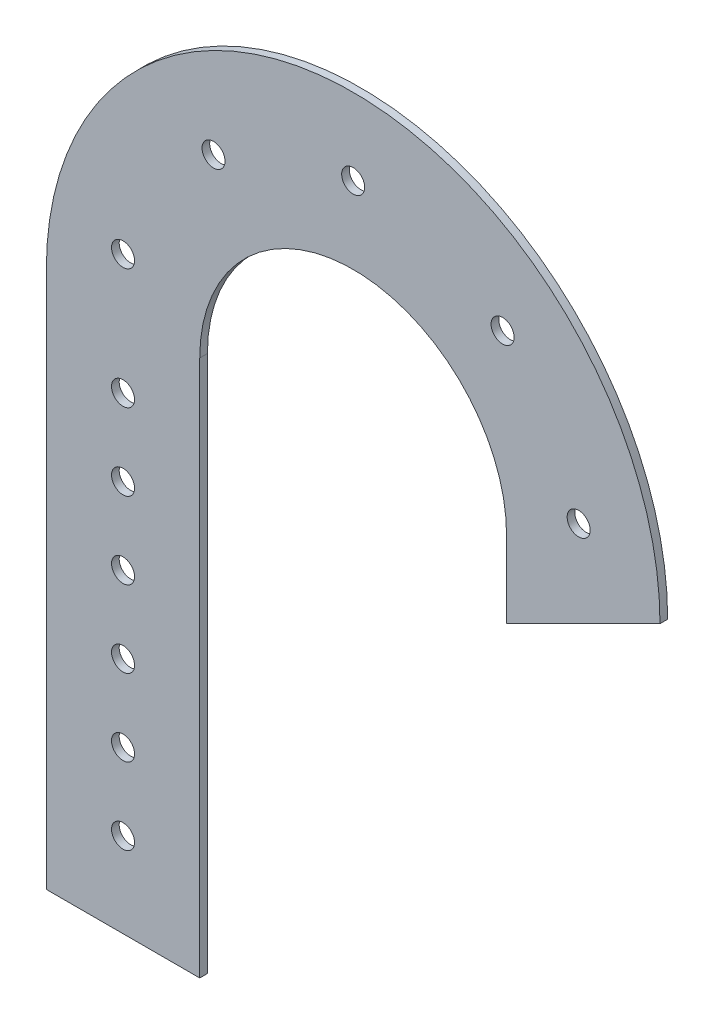
ISO-10303-21;
HEADER;
FILE_DESCRIPTION(('STEP AP214'),'2;1');
FILE_NAME('part.step','',(''),(''),'','','');
FILE_SCHEMA(('AUTOMOTIVE_DESIGN { 1 0 10303 214 1 1 1 1 }'));
ENDSEC;
DATA;
#1=APPLICATION_CONTEXT('core data for automotive mechanical design processes');
#2=APPLICATION_PROTOCOL_DEFINITION('international standard','automotive_design',2000,#1);
#3=PRODUCT_CONTEXT('',#1,'mechanical');
#4=PRODUCT('Part','Part','',(#3));
#5=PRODUCT_RELATED_PRODUCT_CATEGORY('part','',(#4));
#6=PRODUCT_DEFINITION_FORMATION('','',#4);
#7=PRODUCT_DEFINITION_CONTEXT('part definition',#1,'design');
#8=PRODUCT_DEFINITION('design','',#6,#7);
#9=PRODUCT_DEFINITION_SHAPE('','',#8);
#10=(LENGTH_UNIT() NAMED_UNIT(*) SI_UNIT(.MILLI.,.METRE.));
#11=(NAMED_UNIT(*) PLANE_ANGLE_UNIT() SI_UNIT($,.RADIAN.));
#12=(NAMED_UNIT(*) SI_UNIT($,.STERADIAN.) SOLID_ANGLE_UNIT());
#13=UNCERTAINTY_MEASURE_WITH_UNIT(LENGTH_MEASURE(1.E-05),#10,'distance_accuracy_value','');
#14=(GEOMETRIC_REPRESENTATION_CONTEXT(3) GLOBAL_UNCERTAINTY_ASSIGNED_CONTEXT((#13)) GLOBAL_UNIT_ASSIGNED_CONTEXT((#10,
#11,#12)) REPRESENTATION_CONTEXT('',''));
#15=CARTESIAN_POINT('',(0.,0.,0.));
#16=DIRECTION('',(0.,0.,1.));
#17=DIRECTION('',(1.,0.,0.));
#18=AXIS2_PLACEMENT_3D('',#15,#16,#17);
#19=CARTESIAN_POINT('',(0.,0.,2.54));
#20=DIRECTION('',(0.,0.,1.));
#21=DIRECTION('',(1.,0.,0.));
#22=AXIS2_PLACEMENT_3D('',#19,#20,#21);
#23=PLANE('',#22);
#24=CARTESIAN_POINT('',(-76.2,-124.348228379856,2.54));
#25=DIRECTION('',(0.,0.,1.));
#26=DIRECTION('',(1.,0.,0.));
#27=AXIS2_PLACEMENT_3D('',#24,#25,#26);
#28=CIRCLE('',#27,3.81);
#29=CARTESIAN_POINT('',(-72.39,-124.348228379856,2.54));
#30=VERTEX_POINT('',#29);
#31=EDGE_CURVE('E214',#30,#30,#28,.T.);
#32=ORIENTED_EDGE('',*,*,#31,.F.);
#33=EDGE_LOOP('',(#32));
#34=FACE_BOUND('',#33,.T.);
#35=CARTESIAN_POINT('',(-76.2,-73.548228379856,2.54));
#36=DIRECTION('',(0.,0.,1.));
#37=DIRECTION('',(1.,0.,0.));
#38=AXIS2_PLACEMENT_3D('',#35,#36,#37);
#39=CIRCLE('',#38,3.81);
#40=CARTESIAN_POINT('',(-72.39,-73.548228379856,2.54));
#41=VERTEX_POINT('',#40);
#42=EDGE_CURVE('E202',#41,#41,#39,.T.);
#43=ORIENTED_EDGE('',*,*,#42,.F.);
#44=EDGE_LOOP('',(#43));
#45=FACE_BOUND('',#44,.T.);
#46=CARTESIAN_POINT('',(-76.2,-22.748228379856,2.54));
#47=DIRECTION('',(0.,0.,1.));
#48=DIRECTION('',(1.,0.,0.));
#49=AXIS2_PLACEMENT_3D('',#46,#47,#48);
#50=CIRCLE('',#49,3.81);
#51=CARTESIAN_POINT('',(-72.39,-22.748228379856,2.54));
#52=VERTEX_POINT('',#51);
#53=EDGE_CURVE('E190',#52,#52,#50,.T.);
#54=ORIENTED_EDGE('',*,*,#53,.F.);
#55=EDGE_LOOP('',(#54));
#56=FACE_BOUND('',#55,.T.);
#57=CARTESIAN_POINT('',(74.6636960903211,15.2240758712036,2.54));
#58=DIRECTION('',(0.,0.,1.));
#59=DIRECTION('',(1.,0.,0.));
#60=AXIS2_PLACEMENT_3D('',#57,#58,#59);
#61=CIRCLE('',#60,3.81);
#62=CARTESIAN_POINT('',(78.4736960903211,15.2240758712036,2.54));
#63=VERTEX_POINT('',#62);
#64=EDGE_CURVE('E178',#63,#63,#61,.T.);
#65=ORIENTED_EDGE('',*,*,#64,.F.);
#66=EDGE_LOOP('',(#65));
#67=FACE_BOUND('',#66,.T.);
#68=CARTESIAN_POINT('',(-76.2,17.081132640774,2.54));
#69=DIRECTION('',(0.,0.,1.));
#70=DIRECTION('',(1.,0.,0.));
#71=AXIS2_PLACEMENT_3D('',#68,#69,#70);
#72=CIRCLE('',#71,3.81);
#73=CARTESIAN_POINT('',(-72.39,17.081132640774,2.54));
#74=VERTEX_POINT('',#73);
#75=EDGE_CURVE('E166',#74,#74,#72,.T.);
#76=ORIENTED_EDGE('',*,*,#75,.F.);
#77=EDGE_LOOP('',(#76));
#78=FACE_BOUND('',#77,.T.);
#79=DIRECTION('',(1.,0.,0.));
#80=VECTOR('',#79,1.);
#81=CARTESIAN_POINT('',(-101.6,-177.8,2.54));
#82=LINE('',#81,#80);
#83=CARTESIAN_POINT('',(-101.6,-177.8,2.54));
#84=VERTEX_POINT('',#83);
#85=CARTESIAN_POINT('',(-50.8,-177.8,2.54));
#86=VERTEX_POINT('',#85);
#87=EDGE_CURVE('E139',#84,#86,#82,.T.);
#88=ORIENTED_EDGE('',*,*,#87,.T.);
#89=DIRECTION('',(0.,1.,0.));
#90=VECTOR('',#89,1.);
#91=CARTESIAN_POINT('',(-50.8,0.,2.54));
#92=LINE('',#91,#90);
#93=CARTESIAN_POINT('',(-50.8,0.,2.54));
#94=VERTEX_POINT('',#93);
#95=EDGE_CURVE('E92',#86,#94,#92,.T.);
#96=ORIENTED_EDGE('',*,*,#95,.T.);
#97=CARTESIAN_POINT('',(0.,0.,2.54));
#98=DIRECTION('',(0.,0.,-1.));
#99=DIRECTION('',(1.,0.,0.));
#100=AXIS2_PLACEMENT_3D('',#97,#98,#99);
#101=CIRCLE('',#100,50.8);
#102=CARTESIAN_POINT('',(50.8,0.,2.54));
#103=VERTEX_POINT('',#102);
#104=EDGE_CURVE('E151',#94,#103,#101,.T.);
#105=ORIENTED_EDGE('',*,*,#104,.T.);
#106=DIRECTION('',(0.,-1.,0.));
#107=VECTOR('',#106,1.);
#108=CARTESIAN_POINT('',(50.8,0.,2.54));
#109=LINE('',#108,#107);
#110=CARTESIAN_POINT('',(50.8,-25.4,2.54));
#111=VERTEX_POINT('',#110);
#112=EDGE_CURVE('E108',#103,#111,#109,.T.);
#113=ORIENTED_EDGE('',*,*,#112,.T.);
#114=DIRECTION('',(0.894427190999916,0.447213595499957,0.));
#115=VECTOR('',#114,1.);
#116=CARTESIAN_POINT('',(101.6,0.,2.54));
#117=LINE('',#116,#115);
#118=CARTESIAN_POINT('',(101.6,0.,2.54));
#119=VERTEX_POINT('',#118);
#120=EDGE_CURVE('E102',#111,#119,#117,.T.);
#121=ORIENTED_EDGE('',*,*,#120,.T.);
#122=CARTESIAN_POINT('',(0.,0.,2.54));
#123=DIRECTION('',(0.,0.,1.));
#124=DIRECTION('',(1.,0.,0.));
#125=AXIS2_PLACEMENT_3D('',#122,#123,#124);
#126=CIRCLE('',#125,101.6);
#127=CARTESIAN_POINT('',(-101.6,0.,2.54));
#128=VERTEX_POINT('',#127);
#129=EDGE_CURVE('E106',#119,#128,#126,.T.);
#130=ORIENTED_EDGE('',*,*,#129,.T.);
#131=DIRECTION('',(0.,-1.,0.));
#132=VECTOR('',#131,1.);
#133=CARTESIAN_POINT('',(-101.6,0.,2.54));
#134=LINE('',#133,#132);
#135=EDGE_CURVE('E52',#128,#84,#134,.T.);
#136=ORIENTED_EDGE('',*,*,#135,.T.);
#137=EDGE_LOOP('',(#88,#96,#105,#113,#121,#130,#136));
#138=FACE_BOUND('',#137,.T.);
#139=CARTESIAN_POINT('',(-46.2343927009083,60.5707927270083,2.54));
#140=DIRECTION('',(0.,0.,1.));
#141=DIRECTION('',(1.,0.,0.));
#142=AXIS2_PLACEMENT_3D('',#139,#140,#141);
#143=CIRCLE('',#142,3.81);
#144=CARTESIAN_POINT('',(-42.4243927009083,60.5707927270083,2.54));
#145=VERTEX_POINT('',#144);
#146=EDGE_CURVE('E130',#145,#145,#143,.T.);
#147=ORIENTED_EDGE('',*,*,#146,.F.);
#148=EDGE_LOOP('',(#147));
#149=FACE_BOUND('',#148,.T.);
#150=CARTESIAN_POINT('',(0.,76.2,2.54));
#151=DIRECTION('',(0.,0.,1.));
#152=DIRECTION('',(1.,0.,0.));
#153=AXIS2_PLACEMENT_3D('',#150,#151,#152);
#154=CIRCLE('',#153,3.81);
#155=CARTESIAN_POINT('',(3.81,76.2,2.54));
#156=VERTEX_POINT('',#155);
#157=EDGE_CURVE('E172',#156,#156,#154,.T.);
#158=ORIENTED_EDGE('',*,*,#157,.F.);
#159=EDGE_LOOP('',(#158));
#160=FACE_BOUND('',#159,.T.);
#161=CARTESIAN_POINT('',(49.4781723324039,57.951276626533,2.54));
#162=DIRECTION('',(0.,0.,1.));
#163=DIRECTION('',(1.,0.,0.));
#164=AXIS2_PLACEMENT_3D('',#161,#162,#163);
#165=CIRCLE('',#164,3.81);
#166=CARTESIAN_POINT('',(53.2881723324038,57.951276626533,2.54));
#167=VERTEX_POINT('',#166);
#168=EDGE_CURVE('E184',#167,#167,#165,.T.);
#169=ORIENTED_EDGE('',*,*,#168,.F.);
#170=EDGE_LOOP('',(#169));
#171=FACE_BOUND('',#170,.T.);
#172=CARTESIAN_POINT('',(-76.2,-48.148228379856,2.54));
#173=DIRECTION('',(0.,0.,1.));
#174=DIRECTION('',(1.,0.,0.));
#175=AXIS2_PLACEMENT_3D('',#172,#173,#174);
#176=CIRCLE('',#175,3.81);
#177=CARTESIAN_POINT('',(-72.39,-48.148228379856,2.54));
#178=VERTEX_POINT('',#177);
#179=EDGE_CURVE('E196',#178,#178,#176,.T.);
#180=ORIENTED_EDGE('',*,*,#179,.F.);
#181=EDGE_LOOP('',(#180));
#182=FACE_BOUND('',#181,.T.);
#183=CARTESIAN_POINT('',(-76.2,-98.948228379856,2.54));
#184=DIRECTION('',(0.,0.,1.));
#185=DIRECTION('',(1.,0.,0.));
#186=AXIS2_PLACEMENT_3D('',#183,#184,#185);
#187=CIRCLE('',#186,3.81);
#188=CARTESIAN_POINT('',(-72.39,-98.948228379856,2.54));
#189=VERTEX_POINT('',#188);
#190=EDGE_CURVE('E208',#189,#189,#187,.T.);
#191=ORIENTED_EDGE('',*,*,#190,.F.);
#192=EDGE_LOOP('',(#191));
#193=FACE_BOUND('',#192,.T.);
#194=CARTESIAN_POINT('',(-76.2,-149.748228379856,2.54));
#195=DIRECTION('',(0.,0.,1.));
#196=DIRECTION('',(1.,0.,0.));
#197=AXIS2_PLACEMENT_3D('',#194,#195,#196);
#198=CIRCLE('',#197,3.81000000000002);
#199=CARTESIAN_POINT('',(-72.39,-149.748228379856,2.54));
#200=VERTEX_POINT('',#199);
#201=EDGE_CURVE('E220',#200,#200,#198,.T.);
#202=ORIENTED_EDGE('',*,*,#201,.F.);
#203=EDGE_LOOP('',(#202));
#204=FACE_BOUND('',#203,.T.);
#205=ADVANCED_FACE('F35',(#34,#45,#56,#67,#78,#138,#149,#160,#171,#182,#193,#204),#23,.T.);
#206=CARTESIAN_POINT('',(0.,0.,0.));
#207=DIRECTION('',(0.,0.,1.));
#208=DIRECTION('',(1.,0.,0.));
#209=AXIS2_PLACEMENT_3D('',#206,#207,#208);
#210=PLANE('',#209);
#211=DIRECTION('',(1.,0.,0.));
#212=VECTOR('',#211,1.);
#213=CARTESIAN_POINT('',(-101.6,-177.8,0.));
#214=LINE('',#213,#212);
#215=CARTESIAN_POINT('',(-101.6,-177.8,0.));
#216=VERTEX_POINT('',#215);
#217=CARTESIAN_POINT('',(-50.8,-177.8,0.));
#218=VERTEX_POINT('',#217);
#219=EDGE_CURVE('E126',#216,#218,#214,.T.);
#220=ORIENTED_EDGE('',*,*,#219,.F.);
#221=DIRECTION('',(0.,-1.,0.));
#222=VECTOR('',#221,1.);
#223=CARTESIAN_POINT('',(-101.6,0.,0.));
#224=LINE('',#223,#222);
#225=CARTESIAN_POINT('',(-101.6,0.,0.));
#226=VERTEX_POINT('',#225);
#227=EDGE_CURVE('E84',#226,#216,#224,.T.);
#228=ORIENTED_EDGE('',*,*,#227,.F.);
#229=CARTESIAN_POINT('',(0.,0.,0.));
#230=DIRECTION('',(0.,0.,1.));
#231=DIRECTION('',(1.,0.,0.));
#232=AXIS2_PLACEMENT_3D('',#229,#230,#231);
#233=CIRCLE('',#232,101.6);
#234=CARTESIAN_POINT('',(101.6,0.,0.));
#235=VERTEX_POINT('',#234);
#236=EDGE_CURVE('E78',#235,#226,#233,.T.);
#237=ORIENTED_EDGE('',*,*,#236,.F.);
#238=DIRECTION('',(0.894427190999916,0.447213595499957,0.));
#239=VECTOR('',#238,1.);
#240=CARTESIAN_POINT('',(101.6,0.,0.));
#241=LINE('',#240,#239);
#242=CARTESIAN_POINT('',(50.8,-25.4,0.));
#243=VERTEX_POINT('',#242);
#244=EDGE_CURVE('E116',#243,#235,#241,.T.);
#245=ORIENTED_EDGE('',*,*,#244,.F.);
#246=DIRECTION('',(0.,-1.,0.));
#247=VECTOR('',#246,1.);
#248=CARTESIAN_POINT('',(50.8,0.,0.));
#249=LINE('',#248,#247);
#250=CARTESIAN_POINT('',(50.8,0.,0.));
#251=VERTEX_POINT('',#250);
#252=EDGE_CURVE('E134',#251,#243,#249,.T.);
#253=ORIENTED_EDGE('',*,*,#252,.F.);
#254=CARTESIAN_POINT('',(0.,0.,0.));
#255=DIRECTION('',(0.,0.,-1.));
#256=DIRECTION('',(1.,0.,0.));
#257=AXIS2_PLACEMENT_3D('',#254,#255,#256);
#258=CIRCLE('',#257,50.8);
#259=CARTESIAN_POINT('',(-50.8,0.,0.));
#260=VERTEX_POINT('',#259);
#261=EDGE_CURVE('E132',#260,#251,#258,.T.);
#262=ORIENTED_EDGE('',*,*,#261,.F.);
#263=DIRECTION('',(0.,1.,0.));
#264=VECTOR('',#263,1.);
#265=CARTESIAN_POINT('',(-50.8,0.,0.));
#266=LINE('',#265,#264);
#267=EDGE_CURVE('E129',#218,#260,#266,.T.);
#268=ORIENTED_EDGE('',*,*,#267,.F.);
#269=EDGE_LOOP('',(#220,#228,#237,#245,#253,#262,#268));
#270=FACE_BOUND('',#269,.T.);
#271=CARTESIAN_POINT('',(-46.2343927009083,60.5707927270083,0.));
#272=DIRECTION('',(0.,0.,1.));
#273=DIRECTION('',(1.,0.,0.));
#274=AXIS2_PLACEMENT_3D('',#271,#272,#273);
#275=CIRCLE('',#274,3.81);
#276=CARTESIAN_POINT('',(-42.4243927009083,60.5707927270083,0.));
#277=VERTEX_POINT('',#276);
#278=EDGE_CURVE('E163',#277,#277,#275,.T.);
#279=ORIENTED_EDGE('',*,*,#278,.T.);
#280=EDGE_LOOP('',(#279));
#281=FACE_BOUND('',#280,.T.);
#282=CARTESIAN_POINT('',(-76.2,17.081132640774,0.));
#283=DIRECTION('',(0.,0.,1.));
#284=DIRECTION('',(1.,0.,0.));
#285=AXIS2_PLACEMENT_3D('',#282,#283,#284);
#286=CIRCLE('',#285,3.81);
#287=CARTESIAN_POINT('',(-72.39,17.081132640774,0.));
#288=VERTEX_POINT('',#287);
#289=EDGE_CURVE('E169',#288,#288,#286,.T.);
#290=ORIENTED_EDGE('',*,*,#289,.T.);
#291=EDGE_LOOP('',(#290));
#292=FACE_BOUND('',#291,.T.);
#293=CARTESIAN_POINT('',(0.,76.2,0.));
#294=DIRECTION('',(0.,0.,1.));
#295=DIRECTION('',(1.,0.,0.));
#296=AXIS2_PLACEMENT_3D('',#293,#294,#295);
#297=CIRCLE('',#296,3.81);
#298=CARTESIAN_POINT('',(3.81,76.2,0.));
#299=VERTEX_POINT('',#298);
#300=EDGE_CURVE('E175',#299,#299,#297,.T.);
#301=ORIENTED_EDGE('',*,*,#300,.T.);
#302=EDGE_LOOP('',(#301));
#303=FACE_BOUND('',#302,.T.);
#304=CARTESIAN_POINT('',(74.6636960903211,15.2240758712036,0.));
#305=DIRECTION('',(0.,0.,1.));
#306=DIRECTION('',(1.,0.,0.));
#307=AXIS2_PLACEMENT_3D('',#304,#305,#306);
#308=CIRCLE('',#307,3.81);
#309=CARTESIAN_POINT('',(78.4736960903211,15.2240758712036,0.));
#310=VERTEX_POINT('',#309);
#311=EDGE_CURVE('E181',#310,#310,#308,.T.);
#312=ORIENTED_EDGE('',*,*,#311,.T.);
#313=EDGE_LOOP('',(#312));
#314=FACE_BOUND('',#313,.T.);
#315=CARTESIAN_POINT('',(49.4781723324039,57.951276626533,0.));
#316=DIRECTION('',(0.,0.,1.));
#317=DIRECTION('',(1.,0.,0.));
#318=AXIS2_PLACEMENT_3D('',#315,#316,#317);
#319=CIRCLE('',#318,3.81);
#320=CARTESIAN_POINT('',(53.2881723324038,57.951276626533,0.));
#321=VERTEX_POINT('',#320);
#322=EDGE_CURVE('E187',#321,#321,#319,.T.);
#323=ORIENTED_EDGE('',*,*,#322,.T.);
#324=EDGE_LOOP('',(#323));
#325=FACE_BOUND('',#324,.T.);
#326=CARTESIAN_POINT('',(-76.2,-22.748228379856,0.));
#327=DIRECTION('',(0.,0.,1.));
#328=DIRECTION('',(1.,0.,0.));
#329=AXIS2_PLACEMENT_3D('',#326,#327,#328);
#330=CIRCLE('',#329,3.81);
#331=CARTESIAN_POINT('',(-72.39,-22.748228379856,0.));
#332=VERTEX_POINT('',#331);
#333=EDGE_CURVE('E193',#332,#332,#330,.T.);
#334=ORIENTED_EDGE('',*,*,#333,.T.);
#335=EDGE_LOOP('',(#334));
#336=FACE_BOUND('',#335,.T.);
#337=CARTESIAN_POINT('',(-76.2,-48.148228379856,0.));
#338=DIRECTION('',(0.,0.,1.));
#339=DIRECTION('',(1.,0.,0.));
#340=AXIS2_PLACEMENT_3D('',#337,#338,#339);
#341=CIRCLE('',#340,3.81);
#342=CARTESIAN_POINT('',(-72.39,-48.148228379856,0.));
#343=VERTEX_POINT('',#342);
#344=EDGE_CURVE('E199',#343,#343,#341,.T.);
#345=ORIENTED_EDGE('',*,*,#344,.T.);
#346=EDGE_LOOP('',(#345));
#347=FACE_BOUND('',#346,.T.);
#348=CARTESIAN_POINT('',(-76.2,-73.548228379856,0.));
#349=DIRECTION('',(0.,0.,1.));
#350=DIRECTION('',(1.,0.,0.));
#351=AXIS2_PLACEMENT_3D('',#348,#349,#350);
#352=CIRCLE('',#351,3.81);
#353=CARTESIAN_POINT('',(-72.39,-73.548228379856,0.));
#354=VERTEX_POINT('',#353);
#355=EDGE_CURVE('E205',#354,#354,#352,.T.);
#356=ORIENTED_EDGE('',*,*,#355,.T.);
#357=EDGE_LOOP('',(#356));
#358=FACE_BOUND('',#357,.T.);
#359=CARTESIAN_POINT('',(-76.2,-98.948228379856,0.));
#360=DIRECTION('',(0.,0.,1.));
#361=DIRECTION('',(1.,0.,0.));
#362=AXIS2_PLACEMENT_3D('',#359,#360,#361);
#363=CIRCLE('',#362,3.81);
#364=CARTESIAN_POINT('',(-72.39,-98.948228379856,0.));
#365=VERTEX_POINT('',#364);
#366=EDGE_CURVE('E211',#365,#365,#363,.T.);
#367=ORIENTED_EDGE('',*,*,#366,.T.);
#368=EDGE_LOOP('',(#367));
#369=FACE_BOUND('',#368,.T.);
#370=CARTESIAN_POINT('',(-76.2,-124.348228379856,0.));
#371=DIRECTION('',(0.,0.,1.));
#372=DIRECTION('',(1.,0.,0.));
#373=AXIS2_PLACEMENT_3D('',#370,#371,#372);
#374=CIRCLE('',#373,3.81);
#375=CARTESIAN_POINT('',(-72.39,-124.348228379856,0.));
#376=VERTEX_POINT('',#375);
#377=EDGE_CURVE('E217',#376,#376,#374,.T.);
#378=ORIENTED_EDGE('',*,*,#377,.T.);
#379=EDGE_LOOP('',(#378));
#380=FACE_BOUND('',#379,.T.);
#381=CARTESIAN_POINT('',(-76.2,-149.748228379856,0.));
#382=DIRECTION('',(0.,0.,1.));
#383=DIRECTION('',(1.,0.,0.));
#384=AXIS2_PLACEMENT_3D('',#381,#382,#383);
#385=CIRCLE('',#384,3.81000000000002);
#386=CARTESIAN_POINT('',(-72.39,-149.748228379856,0.));
#387=VERTEX_POINT('',#386);
#388=EDGE_CURVE('E223',#387,#387,#385,.T.);
#389=ORIENTED_EDGE('',*,*,#388,.T.);
#390=EDGE_LOOP('',(#389));
#391=FACE_BOUND('',#390,.T.);
#392=ADVANCED_FACE('F155',(#270,#281,#292,#303,#314,#325,#336,#347,#358,#369,#380,#391),#210,.F.);
#393=CARTESIAN_POINT('',(-101.6,-177.8,2.54));
#394=DIRECTION('',(0.,1.,0.));
#395=DIRECTION('',(0.,0.,1.));
#396=AXIS2_PLACEMENT_3D('',#393,#394,#395);
#397=PLANE('',#396);
#398=ORIENTED_EDGE('',*,*,#219,.T.);
#399=DIRECTION('',(0.,0.,-1.));
#400=VECTOR('',#399,1.);
#401=CARTESIAN_POINT('',(-50.8,-177.8,2.54));
#402=LINE('',#401,#400);
#403=EDGE_CURVE('E11',#86,#218,#402,.T.);
#404=ORIENTED_EDGE('',*,*,#403,.F.);
#405=ORIENTED_EDGE('',*,*,#87,.F.);
#406=DIRECTION('',(0.,0.,-1.));
#407=VECTOR('',#406,1.);
#408=CARTESIAN_POINT('',(-101.6,-177.8,2.54));
#409=LINE('',#408,#407);
#410=EDGE_CURVE('E122',#84,#216,#409,.T.);
#411=ORIENTED_EDGE('',*,*,#410,.T.);
#412=EDGE_LOOP('',(#398,#404,#405,#411));
#413=FACE_BOUND('',#412,.T.);
#414=ADVANCED_FACE('F37',(#413),#397,.F.);
#415=CARTESIAN_POINT('',(-50.8,0.,2.54));
#416=DIRECTION('',(-1.,0.,0.));
#417=DIRECTION('',(0.,0.,1.));
#418=AXIS2_PLACEMENT_3D('',#415,#416,#417);
#419=PLANE('',#418);
#420=ORIENTED_EDGE('',*,*,#267,.T.);
#421=DIRECTION('',(0.,0.,-1.));
#422=VECTOR('',#421,1.);
#423=CARTESIAN_POINT('',(-50.8,0.,2.54));
#424=LINE('',#423,#422);
#425=EDGE_CURVE('E44',#94,#260,#424,.T.);
#426=ORIENTED_EDGE('',*,*,#425,.F.);
#427=ORIENTED_EDGE('',*,*,#95,.F.);
#428=ORIENTED_EDGE('',*,*,#403,.T.);
#429=EDGE_LOOP('',(#420,#426,#427,#428));
#430=FACE_BOUND('',#429,.T.);
#431=ADVANCED_FACE('F255',(#430),#419,.F.);
#432=CARTESIAN_POINT('',(0.,0.,2.54));
#433=DIRECTION('',(0.,0.,-1.));
#434=DIRECTION('',(-1.,0.,0.));
#435=AXIS2_PLACEMENT_3D('',#432,#433,#434);
#436=CYLINDRICAL_SURFACE('',#435,50.8);
#437=ORIENTED_EDGE('',*,*,#261,.T.);
#438=DIRECTION('',(0.,0.,-1.));
#439=VECTOR('',#438,1.);
#440=CARTESIAN_POINT('',(50.8,0.,2.54));
#441=LINE('',#440,#439);
#442=EDGE_CURVE('E143',#103,#251,#441,.T.);
#443=ORIENTED_EDGE('',*,*,#442,.F.);
#444=ORIENTED_EDGE('',*,*,#104,.F.);
#445=ORIENTED_EDGE('',*,*,#425,.T.);
#446=EDGE_LOOP('',(#437,#443,#444,#445));
#447=FACE_BOUND('',#446,.T.);
#448=ADVANCED_FACE('F149',(#447),#436,.F.);
#449=CARTESIAN_POINT('',(50.8,0.,2.54));
#450=DIRECTION('',(1.,0.,0.));
#451=DIRECTION('',(0.,0.,-1.));
#452=AXIS2_PLACEMENT_3D('',#449,#450,#451);
#453=PLANE('',#452);
#454=ORIENTED_EDGE('',*,*,#252,.T.);
#455=DIRECTION('',(0.,0.,-1.));
#456=VECTOR('',#455,1.);
#457=CARTESIAN_POINT('',(50.8,-25.4,2.54));
#458=LINE('',#457,#456);
#459=EDGE_CURVE('E117',#111,#243,#458,.T.);
#460=ORIENTED_EDGE('',*,*,#459,.F.);
#461=ORIENTED_EDGE('',*,*,#112,.F.);
#462=ORIENTED_EDGE('',*,*,#442,.T.);
#463=EDGE_LOOP('',(#454,#460,#461,#462));
#464=FACE_BOUND('',#463,.T.);
#465=ADVANCED_FACE('F158',(#464),#453,.F.);
#466=CARTESIAN_POINT('',(101.6,0.,2.54));
#467=DIRECTION('',(-0.447213595499957,0.894427190999916,0.));
#468=DIRECTION('',(-0.894427190999916,-0.447213595499957,0.));
#469=AXIS2_PLACEMENT_3D('',#466,#467,#468);
#470=PLANE('',#469);
#471=ORIENTED_EDGE('',*,*,#244,.T.);
#472=DIRECTION('',(0.,0.,-1.));
#473=VECTOR('',#472,1.);
#474=CARTESIAN_POINT('',(101.6,0.,2.54));
#475=LINE('',#474,#473);
#476=EDGE_CURVE('E113',#119,#235,#475,.T.);
#477=ORIENTED_EDGE('',*,*,#476,.F.);
#478=ORIENTED_EDGE('',*,*,#120,.F.);
#479=ORIENTED_EDGE('',*,*,#459,.T.);
#480=EDGE_LOOP('',(#471,#477,#478,#479));
#481=FACE_BOUND('',#480,.T.);
#482=ADVANCED_FACE('F114',(#481),#470,.F.);
#483=CARTESIAN_POINT('',(0.,0.,2.54));
#484=DIRECTION('',(0.,0.,-1.));
#485=DIRECTION('',(-1.,0.,0.));
#486=AXIS2_PLACEMENT_3D('',#483,#484,#485);
#487=CYLINDRICAL_SURFACE('',#486,101.6);
#488=ORIENTED_EDGE('',*,*,#236,.T.);
#489=DIRECTION('',(0.,0.,-1.));
#490=VECTOR('',#489,1.);
#491=CARTESIAN_POINT('',(-101.6,0.,2.54));
#492=LINE('',#491,#490);
#493=EDGE_CURVE('E118',#128,#226,#492,.T.);
#494=ORIENTED_EDGE('',*,*,#493,.F.);
#495=ORIENTED_EDGE('',*,*,#129,.F.);
#496=ORIENTED_EDGE('',*,*,#476,.T.);
#497=EDGE_LOOP('',(#488,#494,#495,#496));
#498=FACE_BOUND('',#497,.T.);
#499=ADVANCED_FACE('F120',(#498),#487,.T.);
#500=CARTESIAN_POINT('',(-101.6,0.,2.54));
#501=DIRECTION('',(1.,0.,0.));
#502=DIRECTION('',(0.,1.,0.));
#503=AXIS2_PLACEMENT_3D('',#500,#501,#502);
#504=PLANE('',#503);
#505=ORIENTED_EDGE('',*,*,#227,.T.);
#506=ORIENTED_EDGE('',*,*,#410,.F.);
#507=ORIENTED_EDGE('',*,*,#135,.F.);
#508=ORIENTED_EDGE('',*,*,#493,.T.);
#509=EDGE_LOOP('',(#505,#506,#507,#508));
#510=FACE_BOUND('',#509,.T.);
#511=ADVANCED_FACE('F245',(#510),#504,.F.);
#512=CARTESIAN_POINT('',(-46.2343927009083,60.5707927270083,2.54));
#513=DIRECTION('',(0.,0.,-1.));
#514=DIRECTION('',(-1.,0.,0.));
#515=AXIS2_PLACEMENT_3D('',#512,#513,#514);
#516=CYLINDRICAL_SURFACE('',#515,3.81);
#517=ORIENTED_EDGE('',*,*,#146,.T.);
#518=EDGE_LOOP('',(#517));
#519=FACE_BOUND('',#518,.T.);
#520=ORIENTED_EDGE('',*,*,#278,.F.);
#521=EDGE_LOOP('',(#520));
#522=FACE_BOUND('',#521,.T.);
#523=ADVANCED_FACE('F242',(#519,#522),#516,.F.);
#524=CARTESIAN_POINT('',(-76.2,17.081132640774,2.54));
#525=DIRECTION('',(0.,0.,-1.));
#526=DIRECTION('',(-1.,0.,0.));
#527=AXIS2_PLACEMENT_3D('',#524,#525,#526);
#528=CYLINDRICAL_SURFACE('',#527,3.81);
#529=ORIENTED_EDGE('',*,*,#75,.T.);
#530=EDGE_LOOP('',(#529));
#531=FACE_BOUND('',#530,.T.);
#532=ORIENTED_EDGE('',*,*,#289,.F.);
#533=EDGE_LOOP('',(#532));
#534=FACE_BOUND('',#533,.T.);
#535=ADVANCED_FACE('F314',(#531,#534),#528,.F.);
#536=CARTESIAN_POINT('',(0.,76.2,2.54));
#537=DIRECTION('',(0.,0.,-1.));
#538=DIRECTION('',(-1.,0.,0.));
#539=AXIS2_PLACEMENT_3D('',#536,#537,#538);
#540=CYLINDRICAL_SURFACE('',#539,3.81);
#541=ORIENTED_EDGE('',*,*,#157,.T.);
#542=EDGE_LOOP('',(#541));
#543=FACE_BOUND('',#542,.T.);
#544=ORIENTED_EDGE('',*,*,#300,.F.);
#545=EDGE_LOOP('',(#544));
#546=FACE_BOUND('',#545,.T.);
#547=ADVANCED_FACE('F322',(#543,#546),#540,.F.);
#548=CARTESIAN_POINT('',(74.6636960903211,15.2240758712036,2.54));
#549=DIRECTION('',(0.,0.,-1.));
#550=DIRECTION('',(-1.,0.,0.));
#551=AXIS2_PLACEMENT_3D('',#548,#549,#550);
#552=CYLINDRICAL_SURFACE('',#551,3.81);
#553=ORIENTED_EDGE('',*,*,#64,.T.);
#554=EDGE_LOOP('',(#553));
#555=FACE_BOUND('',#554,.T.);
#556=ORIENTED_EDGE('',*,*,#311,.F.);
#557=EDGE_LOOP('',(#556));
#558=FACE_BOUND('',#557,.T.);
#559=ADVANCED_FACE('F330',(#555,#558),#552,.F.);
#560=CARTESIAN_POINT('',(49.4781723324039,57.951276626533,2.54));
#561=DIRECTION('',(0.,0.,-1.));
#562=DIRECTION('',(-1.,0.,0.));
#563=AXIS2_PLACEMENT_3D('',#560,#561,#562);
#564=CYLINDRICAL_SURFACE('',#563,3.81);
#565=ORIENTED_EDGE('',*,*,#168,.T.);
#566=EDGE_LOOP('',(#565));
#567=FACE_BOUND('',#566,.T.);
#568=ORIENTED_EDGE('',*,*,#322,.F.);
#569=EDGE_LOOP('',(#568));
#570=FACE_BOUND('',#569,.T.);
#571=ADVANCED_FACE('F339',(#567,#570),#564,.F.);
#572=CARTESIAN_POINT('',(-76.2,-22.748228379856,2.54));
#573=DIRECTION('',(0.,0.,-1.));
#574=DIRECTION('',(-1.,0.,0.));
#575=AXIS2_PLACEMENT_3D('',#572,#573,#574);
#576=CYLINDRICAL_SURFACE('',#575,3.81);
#577=ORIENTED_EDGE('',*,*,#53,.T.);
#578=EDGE_LOOP('',(#577));
#579=FACE_BOUND('',#578,.T.);
#580=ORIENTED_EDGE('',*,*,#333,.F.);
#581=EDGE_LOOP('',(#580));
#582=FACE_BOUND('',#581,.T.);
#583=ADVANCED_FACE('F348',(#579,#582),#576,.F.);
#584=CARTESIAN_POINT('',(-76.2,-48.148228379856,2.54));
#585=DIRECTION('',(0.,0.,-1.));
#586=DIRECTION('',(-1.,0.,0.));
#587=AXIS2_PLACEMENT_3D('',#584,#585,#586);
#588=CYLINDRICAL_SURFACE('',#587,3.81);
#589=ORIENTED_EDGE('',*,*,#179,.T.);
#590=EDGE_LOOP('',(#589));
#591=FACE_BOUND('',#590,.T.);
#592=ORIENTED_EDGE('',*,*,#344,.F.);
#593=EDGE_LOOP('',(#592));
#594=FACE_BOUND('',#593,.T.);
#595=ADVANCED_FACE('F357',(#591,#594),#588,.F.);
#596=CARTESIAN_POINT('',(-76.2,-73.548228379856,2.54));
#597=DIRECTION('',(0.,0.,-1.));
#598=DIRECTION('',(-1.,0.,0.));
#599=AXIS2_PLACEMENT_3D('',#596,#597,#598);
#600=CYLINDRICAL_SURFACE('',#599,3.81);
#601=ORIENTED_EDGE('',*,*,#42,.T.);
#602=EDGE_LOOP('',(#601));
#603=FACE_BOUND('',#602,.T.);
#604=ORIENTED_EDGE('',*,*,#355,.F.);
#605=EDGE_LOOP('',(#604));
#606=FACE_BOUND('',#605,.T.);
#607=ADVANCED_FACE('F366',(#603,#606),#600,.F.);
#608=CARTESIAN_POINT('',(-76.2,-98.948228379856,2.54));
#609=DIRECTION('',(0.,0.,-1.));
#610=DIRECTION('',(-1.,0.,0.));
#611=AXIS2_PLACEMENT_3D('',#608,#609,#610);
#612=CYLINDRICAL_SURFACE('',#611,3.81);
#613=ORIENTED_EDGE('',*,*,#190,.T.);
#614=EDGE_LOOP('',(#613));
#615=FACE_BOUND('',#614,.T.);
#616=ORIENTED_EDGE('',*,*,#366,.F.);
#617=EDGE_LOOP('',(#616));
#618=FACE_BOUND('',#617,.T.);
#619=ADVANCED_FACE('F375',(#615,#618),#612,.F.);
#620=CARTESIAN_POINT('',(-76.2,-124.348228379856,2.54));
#621=DIRECTION('',(0.,0.,-1.));
#622=DIRECTION('',(-1.,0.,0.));
#623=AXIS2_PLACEMENT_3D('',#620,#621,#622);
#624=CYLINDRICAL_SURFACE('',#623,3.81);
#625=ORIENTED_EDGE('',*,*,#31,.T.);
#626=EDGE_LOOP('',(#625));
#627=FACE_BOUND('',#626,.T.);
#628=ORIENTED_EDGE('',*,*,#377,.F.);
#629=EDGE_LOOP('',(#628));
#630=FACE_BOUND('',#629,.T.);
#631=ADVANCED_FACE('F384',(#627,#630),#624,.F.);
#632=CARTESIAN_POINT('',(-76.2,-149.748228379856,2.54));
#633=DIRECTION('',(0.,0.,-1.));
#634=DIRECTION('',(-1.,0.,0.));
#635=AXIS2_PLACEMENT_3D('',#632,#633,#634);
#636=CYLINDRICAL_SURFACE('',#635,3.81000000000002);
#637=ORIENTED_EDGE('',*,*,#201,.T.);
#638=EDGE_LOOP('',(#637));
#639=FACE_BOUND('',#638,.T.);
#640=ORIENTED_EDGE('',*,*,#388,.F.);
#641=EDGE_LOOP('',(#640));
#642=FACE_BOUND('',#641,.T.);
#643=ADVANCED_FACE('F229',(#639,#642),#636,.F.);
#644=CLOSED_SHELL('',(#205,#392,#414,#431,#448,#465,#482,#499,#511,#523,#535,#547,#559,#571,
#583,#595,#607,#619,#631,#643));
#645=MANIFOLD_SOLID_BREP('B2',#644);
#646=ADVANCED_BREP_SHAPE_REPRESENTATION('',(#18,#645),#14);
#647=SHAPE_DEFINITION_REPRESENTATION(#9,#646);
ENDSEC;
END-ISO-10303-21;
